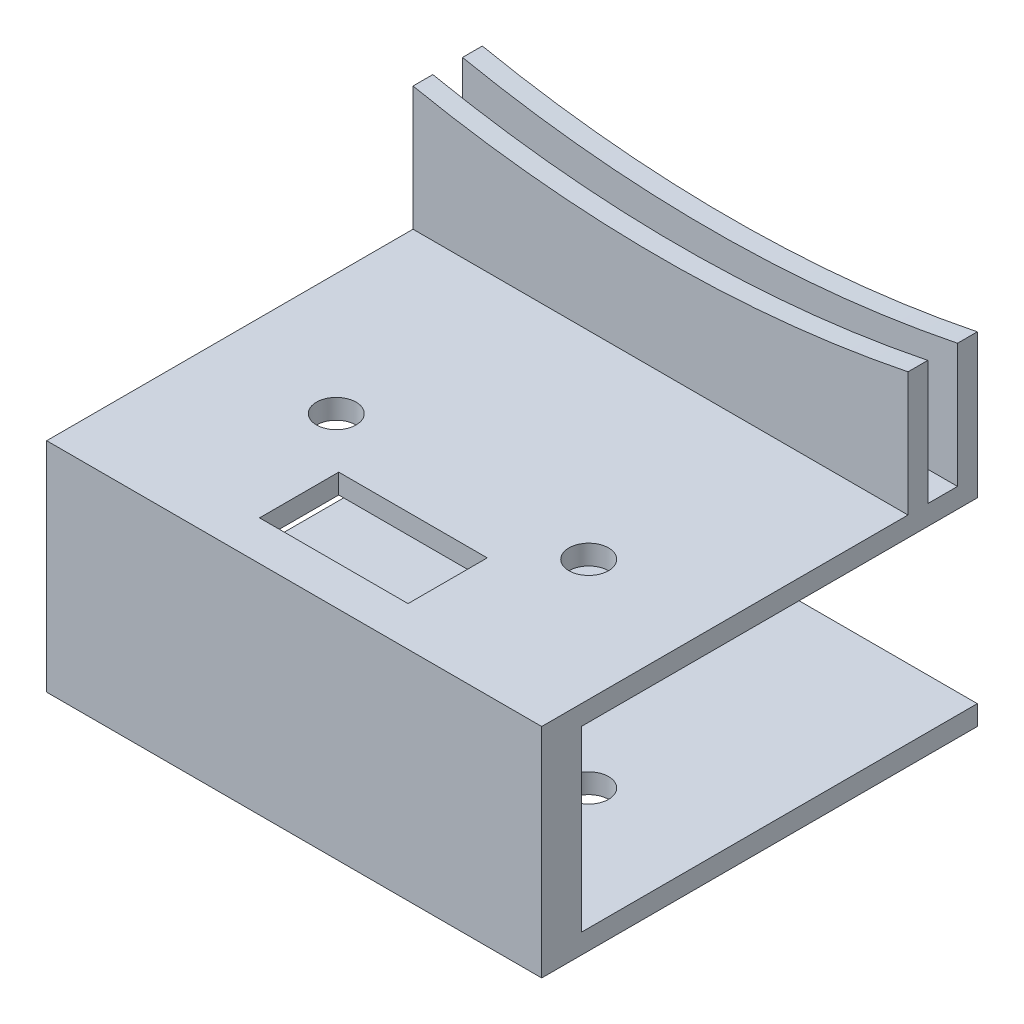
ISO-10303-21;
HEADER;
FILE_DESCRIPTION(('STEP AP214'),'2;1');
FILE_NAME('part.step','',(''),(''),'','','');
FILE_SCHEMA(('AUTOMOTIVE_DESIGN { 1 0 10303 214 1 1 1 1 }'));
ENDSEC;
DATA;
#1=APPLICATION_CONTEXT('core data for automotive mechanical design processes');
#2=APPLICATION_PROTOCOL_DEFINITION('international standard','automotive_design',2000,#1);
#3=PRODUCT_CONTEXT('',#1,'mechanical');
#4=PRODUCT('Part','Part','',(#3));
#5=PRODUCT_RELATED_PRODUCT_CATEGORY('part','',(#4));
#6=PRODUCT_DEFINITION_FORMATION('','',#4);
#7=PRODUCT_DEFINITION_CONTEXT('part definition',#1,'design');
#8=PRODUCT_DEFINITION('design','',#6,#7);
#9=PRODUCT_DEFINITION_SHAPE('','',#8);
#10=(LENGTH_UNIT() NAMED_UNIT(*) SI_UNIT(.MILLI.,.METRE.));
#11=(NAMED_UNIT(*) PLANE_ANGLE_UNIT() SI_UNIT($,.RADIAN.));
#12=(NAMED_UNIT(*) SI_UNIT($,.STERADIAN.) SOLID_ANGLE_UNIT());
#13=UNCERTAINTY_MEASURE_WITH_UNIT(LENGTH_MEASURE(1.E-05),#10,'distance_accuracy_value','');
#14=(GEOMETRIC_REPRESENTATION_CONTEXT(3) GLOBAL_UNCERTAINTY_ASSIGNED_CONTEXT((#13)) GLOBAL_UNIT_ASSIGNED_CONTEXT((#10,
#11,#12)) REPRESENTATION_CONTEXT('',''));
#15=CARTESIAN_POINT('',(0.,0.,0.));
#16=DIRECTION('',(0.,0.,1.));
#17=DIRECTION('',(1.,0.,0.));
#18=AXIS2_PLACEMENT_3D('',#15,#16,#17);
#19=CARTESIAN_POINT('',(-25.,22.,-22.));
#20=DIRECTION('',(0.,0.,1.));
#21=DIRECTION('',(1.,0.,0.));
#22=AXIS2_PLACEMENT_3D('',#19,#20,#21);
#23=PLANE('',#22);
#24=DIRECTION('',(0.,-1.,0.));
#25=VECTOR('',#24,1.);
#26=CARTESIAN_POINT('',(-25.,22.,-22.));
#27=LINE('',#26,#25);
#28=CARTESIAN_POINT('',(-25.,2.,-22.));
#29=VERTEX_POINT('',#28);
#30=CARTESIAN_POINT('',(-25.,0.,-22.));
#31=VERTEX_POINT('',#30);
#32=EDGE_CURVE('E214',#29,#31,#27,.T.);
#33=ORIENTED_EDGE('',*,*,#32,.F.);
#34=DIRECTION('',(1.,0.,0.));
#35=VECTOR('',#34,1.);
#36=CARTESIAN_POINT('',(-25.,2.,-22.));
#37=LINE('',#36,#35);
#38=CARTESIAN_POINT('',(25.,2.,-22.));
#39=VERTEX_POINT('',#38);
#40=EDGE_CURVE('E268',#29,#39,#37,.T.);
#41=ORIENTED_EDGE('',*,*,#40,.T.);
#42=DIRECTION('',(0.,-1.,0.));
#43=VECTOR('',#42,1.);
#44=CARTESIAN_POINT('',(25.,22.,-22.));
#45=LINE('',#44,#43);
#46=CARTESIAN_POINT('',(25.,0.,-22.));
#47=VERTEX_POINT('',#46);
#48=EDGE_CURVE('E217',#39,#47,#45,.T.);
#49=ORIENTED_EDGE('',*,*,#48,.T.);
#50=DIRECTION('',(-1.,0.,0.));
#51=VECTOR('',#50,1.);
#52=CARTESIAN_POINT('',(-25.,0.,-22.));
#53=LINE('',#52,#51);
#54=EDGE_CURVE('E202',#47,#31,#53,.T.);
#55=ORIENTED_EDGE('',*,*,#54,.T.);
#56=EDGE_LOOP('',(#33,#41,#49,#55));
#57=FACE_BOUND('',#56,.T.);
#58=ADVANCED_FACE('F33',(#57),#23,.F.);
#59=CARTESIAN_POINT('',(0.,22.,0.));
#60=DIRECTION('',(0.,1.,0.));
#61=DIRECTION('',(0.,0.,1.));
#62=AXIS2_PLACEMENT_3D('',#59,#60,#61);
#63=PLANE('',#62);
#64=DIRECTION('',(0.,0.,1.));
#65=VECTOR('',#64,1.);
#66=CARTESIAN_POINT('',(-7.5,22.,10.));
#67=LINE('',#66,#65);
#68=CARTESIAN_POINT('',(-7.5,22.,10.));
#69=VERTEX_POINT('',#68);
#70=CARTESIAN_POINT('',(-7.49999999999999,22.,18.));
#71=VERTEX_POINT('',#70);
#72=EDGE_CURVE('E337',#69,#71,#67,.T.);
#73=ORIENTED_EDGE('',*,*,#72,.F.);
#74=DIRECTION('',(-1.,0.,0.));
#75=VECTOR('',#74,1.);
#76=CARTESIAN_POINT('',(-7.5,22.,10.));
#77=LINE('',#76,#75);
#78=CARTESIAN_POINT('',(7.5,22.,10.));
#79=VERTEX_POINT('',#78);
#80=EDGE_CURVE('E333',#79,#69,#77,.T.);
#81=ORIENTED_EDGE('',*,*,#80,.F.);
#82=DIRECTION('',(0.,0.,-1.));
#83=VECTOR('',#82,1.);
#84=CARTESIAN_POINT('',(7.5,22.,10.));
#85=LINE('',#84,#83);
#86=CARTESIAN_POINT('',(7.5,22.,18.));
#87=VERTEX_POINT('',#86);
#88=EDGE_CURVE('E341',#87,#79,#85,.T.);
#89=ORIENTED_EDGE('',*,*,#88,.F.);
#90=DIRECTION('',(1.,0.,0.));
#91=VECTOR('',#90,1.);
#92=CARTESIAN_POINT('',(-7.49999999999999,22.,18.));
#93=LINE('',#92,#91);
#94=EDGE_CURVE('E339',#71,#87,#93,.T.);
#95=ORIENTED_EDGE('',*,*,#94,.F.);
#96=EDGE_LOOP('',(#73,#81,#89,#95));
#97=FACE_BOUND('',#96,.T.);
#98=CARTESIAN_POINT('',(-12.75,22.,5.));
#99=DIRECTION('',(0.,-1.,0.));
#100=DIRECTION('',(0.,0.,-1.));
#101=AXIS2_PLACEMENT_3D('',#98,#99,#100);
#102=CIRCLE('',#101,2.);
#103=CARTESIAN_POINT('',(-12.75,22.,3.));
#104=VERTEX_POINT('',#103);
#105=EDGE_CURVE('E226',#104,#104,#102,.T.);
#106=ORIENTED_EDGE('',*,*,#105,.T.);
#107=EDGE_LOOP('',(#106));
#108=FACE_BOUND('',#107,.T.);
#109=CARTESIAN_POINT('',(12.75,22.,5.));
#110=DIRECTION('',(0.,-1.,0.));
#111=DIRECTION('',(0.,0.,-1.));
#112=AXIS2_PLACEMENT_3D('',#109,#110,#111);
#113=CIRCLE('',#112,2.);
#114=CARTESIAN_POINT('',(12.75,22.,3.));
#115=VERTEX_POINT('',#114);
#116=EDGE_CURVE('E222',#115,#115,#113,.T.);
#117=ORIENTED_EDGE('',*,*,#116,.T.);
#118=EDGE_LOOP('',(#117));
#119=FACE_BOUND('',#118,.T.);
#120=DIRECTION('',(0.,0.,-1.));
#121=VECTOR('',#120,1.);
#122=CARTESIAN_POINT('',(25.,22.,-22.));
#123=LINE('',#122,#121);
#124=CARTESIAN_POINT('',(25.,22.,22.));
#125=VERTEX_POINT('',#124);
#126=CARTESIAN_POINT('',(25.,22.,-15.));
#127=VERTEX_POINT('',#126);
#128=EDGE_CURVE('E190',#125,#127,#123,.T.);
#129=ORIENTED_EDGE('',*,*,#128,.T.);
#130=DIRECTION('',(1.,0.,0.));
#131=VECTOR('',#130,1.);
#132=CARTESIAN_POINT('',(-25.,22.,-15.));
#133=LINE('',#132,#131);
#134=CARTESIAN_POINT('',(-25.,22.,-15.));
#135=VERTEX_POINT('',#134);
#136=EDGE_CURVE('E271',#135,#127,#133,.T.);
#137=ORIENTED_EDGE('',*,*,#136,.F.);
#138=DIRECTION('',(0.,0.,1.));
#139=VECTOR('',#138,1.);
#140=CARTESIAN_POINT('',(-25.,22.,-22.));
#141=LINE('',#140,#139);
#142=CARTESIAN_POINT('',(-25.,22.,22.));
#143=VERTEX_POINT('',#142);
#144=EDGE_CURVE('E176',#135,#143,#141,.T.);
#145=ORIENTED_EDGE('',*,*,#144,.T.);
#146=DIRECTION('',(1.,0.,0.));
#147=VECTOR('',#146,1.);
#148=CARTESIAN_POINT('',(-25.,22.,22.));
#149=LINE('',#148,#147);
#150=EDGE_CURVE('E197',#143,#125,#149,.T.);
#151=ORIENTED_EDGE('',*,*,#150,.T.);
#152=EDGE_LOOP('',(#129,#137,#145,#151));
#153=FACE_BOUND('',#152,.T.);
#154=ADVANCED_FACE('F355',(#97,#108,#119,#153),#63,.T.);
#155=CARTESIAN_POINT('',(-25.,22.,-20.));
#156=VERTEX_POINT('',#155);
#157=CARTESIAN_POINT('',(-25.,22.,-17.));
#158=VERTEX_POINT('',#157);
#159=EDGE_CURVE('E194',#156,#158,#141,.T.);
#160=ORIENTED_EDGE('',*,*,#159,.T.);
#161=DIRECTION('',(-1.,0.,0.));
#162=VECTOR('',#161,1.);
#163=CARTESIAN_POINT('',(-25.,22.,-17.));
#164=LINE('',#163,#162);
#165=CARTESIAN_POINT('',(25.,22.,-17.));
#166=VERTEX_POINT('',#165);
#167=EDGE_CURVE('E281',#166,#158,#164,.T.);
#168=ORIENTED_EDGE('',*,*,#167,.F.);
#169=CARTESIAN_POINT('',(25.,22.,-20.));
#170=VERTEX_POINT('',#169);
#171=EDGE_CURVE('E193',#166,#170,#123,.T.);
#172=ORIENTED_EDGE('',*,*,#171,.T.);
#173=DIRECTION('',(1.,0.,0.));
#174=VECTOR('',#173,1.);
#175=CARTESIAN_POINT('',(-25.,22.,-20.));
#176=LINE('',#175,#174);
#177=EDGE_CURVE('E177',#156,#170,#176,.T.);
#178=ORIENTED_EDGE('',*,*,#177,.F.);
#179=EDGE_LOOP('',(#160,#168,#172,#178));
#180=FACE_BOUND('',#179,.T.);
#181=ADVANCED_FACE('F293',(#180),#63,.T.);
#182=CARTESIAN_POINT('',(25.,22.,-22.));
#183=DIRECTION('',(-1.,0.,0.));
#184=DIRECTION('',(0.,0.,1.));
#185=AXIS2_PLACEMENT_3D('',#182,#183,#184);
#186=PLANE('',#185);
#187=CARTESIAN_POINT('',(25.,34.5255128608411,-22.));
#188=VERTEX_POINT('',#187);
#189=CARTESIAN_POINT('',(25.,20.,-22.));
#190=VERTEX_POINT('',#189);
#191=EDGE_CURVE('E41',#188,#190,#45,.T.);
#192=ORIENTED_EDGE('',*,*,#191,.F.);
#193=DIRECTION('',(0.,0.,-1.));
#194=VECTOR('',#193,1.);
#195=CARTESIAN_POINT('',(25.,34.5255128608411,-15.));
#196=LINE('',#195,#194);
#197=CARTESIAN_POINT('',(25.,34.5255128608411,-20.));
#198=VERTEX_POINT('',#197);
#199=EDGE_CURVE('E162',#198,#188,#196,.T.);
#200=ORIENTED_EDGE('',*,*,#199,.F.);
#201=DIRECTION('',(0.,-1.,0.));
#202=VECTOR('',#201,1.);
#203=CARTESIAN_POINT('',(25.,42.,-20.));
#204=LINE('',#203,#202);
#205=EDGE_CURVE('E180',#198,#170,#204,.T.);
#206=ORIENTED_EDGE('',*,*,#205,.T.);
#207=ORIENTED_EDGE('',*,*,#171,.F.);
#208=DIRECTION('',(0.,-1.,0.));
#209=VECTOR('',#208,1.);
#210=CARTESIAN_POINT('',(25.,42.,-17.));
#211=LINE('',#210,#209);
#212=CARTESIAN_POINT('',(25.,34.5255128608411,-17.));
#213=VERTEX_POINT('',#212);
#214=EDGE_CURVE('E182',#213,#166,#211,.T.);
#215=ORIENTED_EDGE('',*,*,#214,.F.);
#216=CARTESIAN_POINT('',(25.,34.5255128608411,-15.));
#217=VERTEX_POINT('',#216);
#218=EDGE_CURVE('E56',#217,#213,#196,.T.);
#219=ORIENTED_EDGE('',*,*,#218,.F.);
#220=DIRECTION('',(0.,-1.,0.));
#221=VECTOR('',#220,1.);
#222=CARTESIAN_POINT('',(25.,42.,-15.));
#223=LINE('',#222,#221);
#224=EDGE_CURVE('E170',#217,#127,#223,.T.);
#225=ORIENTED_EDGE('',*,*,#224,.T.);
#226=ORIENTED_EDGE('',*,*,#128,.F.);
#227=DIRECTION('',(0.,-1.,0.));
#228=VECTOR('',#227,1.);
#229=CARTESIAN_POINT('',(25.,22.,22.));
#230=LINE('',#229,#228);
#231=CARTESIAN_POINT('',(25.,0.,22.));
#232=VERTEX_POINT('',#231);
#233=EDGE_CURVE('E199',#125,#232,#230,.T.);
#234=ORIENTED_EDGE('',*,*,#233,.T.);
#235=DIRECTION('',(0.,0.,-1.));
#236=VECTOR('',#235,1.);
#237=CARTESIAN_POINT('',(25.,0.,-22.));
#238=LINE('',#237,#236);
#239=EDGE_CURVE('E189',#232,#47,#238,.T.);
#240=ORIENTED_EDGE('',*,*,#239,.T.);
#241=ORIENTED_EDGE('',*,*,#48,.F.);
#242=DIRECTION('',(0.,0.,-1.));
#243=VECTOR('',#242,1.);
#244=CARTESIAN_POINT('',(25.,2.,-22.));
#245=LINE('',#244,#243);
#246=CARTESIAN_POINT('',(25.,2.,18.));
#247=VERTEX_POINT('',#246);
#248=EDGE_CURVE('E255',#247,#39,#245,.T.);
#249=ORIENTED_EDGE('',*,*,#248,.F.);
#250=DIRECTION('',(0.,-1.,0.));
#251=VECTOR('',#250,1.);
#252=CARTESIAN_POINT('',(25.,20.,18.));
#253=LINE('',#252,#251);
#254=CARTESIAN_POINT('',(25.,20.,18.));
#255=VERTEX_POINT('',#254);
#256=EDGE_CURVE('E264',#255,#247,#253,.T.);
#257=ORIENTED_EDGE('',*,*,#256,.F.);
#258=DIRECTION('',(0.,0.,1.));
#259=VECTOR('',#258,1.);
#260=CARTESIAN_POINT('',(25.,20.,-22.));
#261=LINE('',#260,#259);
#262=EDGE_CURVE('E250',#190,#255,#261,.T.);
#263=ORIENTED_EDGE('',*,*,#262,.F.);
#264=EDGE_LOOP('',(#192,#200,#206,#207,#215,#219,#225,#226,#234,#240,#241,#249,#257,#263));
#265=FACE_BOUND('',#264,.T.);
#266=ADVANCED_FACE('F35',(#265),#186,.F.);
#267=CARTESIAN_POINT('',(-25.,34.5255128608411,-22.));
#268=VERTEX_POINT('',#267);
#269=CARTESIAN_POINT('',(-25.,20.,-22.));
#270=VERTEX_POINT('',#269);
#271=EDGE_CURVE('E215',#268,#270,#27,.T.);
#272=ORIENTED_EDGE('',*,*,#271,.F.);
#273=CARTESIAN_POINT('',(0.,157.,-22.));
#274=DIRECTION('',(0.,0.,-1.));
#275=DIRECTION('',(1.,0.,0.));
#276=AXIS2_PLACEMENT_3D('',#273,#274,#275);
#277=CIRCLE('',#276,125.);
#278=EDGE_CURVE('E171',#188,#268,#277,.T.);
#279=ORIENTED_EDGE('',*,*,#278,.F.);
#280=ORIENTED_EDGE('',*,*,#191,.T.);
#281=DIRECTION('',(1.,0.,0.));
#282=VECTOR('',#281,1.);
#283=CARTESIAN_POINT('',(-25.,20.,-22.));
#284=LINE('',#283,#282);
#285=EDGE_CURVE('E261',#270,#190,#284,.T.);
#286=ORIENTED_EDGE('',*,*,#285,.F.);
#287=EDGE_LOOP('',(#272,#279,#280,#286));
#288=FACE_BOUND('',#287,.T.);
#289=ADVANCED_FACE('F308',(#288),#23,.F.);
#290=CARTESIAN_POINT('',(-25.,22.,-22.));
#291=DIRECTION('',(1.,0.,0.));
#292=DIRECTION('',(0.,0.,-1.));
#293=AXIS2_PLACEMENT_3D('',#290,#291,#292);
#294=PLANE('',#293);
#295=DIRECTION('',(0.,-1.,0.));
#296=VECTOR('',#295,1.);
#297=CARTESIAN_POINT('',(-25.,42.,-15.));
#298=LINE('',#297,#296);
#299=CARTESIAN_POINT('',(-25.,34.5255128608411,-15.));
#300=VERTEX_POINT('',#299);
#301=EDGE_CURVE('E168',#300,#135,#298,.T.);
#302=ORIENTED_EDGE('',*,*,#301,.F.);
#303=DIRECTION('',(0.,0.,-1.));
#304=VECTOR('',#303,1.);
#305=CARTESIAN_POINT('',(-25.,34.5255128608411,-15.));
#306=LINE('',#305,#304);
#307=CARTESIAN_POINT('',(-25.,34.5255128608411,-17.));
#308=VERTEX_POINT('',#307);
#309=EDGE_CURVE('E155',#300,#308,#306,.T.);
#310=ORIENTED_EDGE('',*,*,#309,.T.);
#311=DIRECTION('',(0.,-1.,0.));
#312=VECTOR('',#311,1.);
#313=CARTESIAN_POINT('',(-25.,42.,-17.));
#314=LINE('',#313,#312);
#315=EDGE_CURVE('E284',#308,#158,#314,.T.);
#316=ORIENTED_EDGE('',*,*,#315,.T.);
#317=ORIENTED_EDGE('',*,*,#159,.F.);
#318=DIRECTION('',(0.,-1.,0.));
#319=VECTOR('',#318,1.);
#320=CARTESIAN_POINT('',(-25.,42.,-20.));
#321=LINE('',#320,#319);
#322=CARTESIAN_POINT('',(-25.,34.5255128608411,-20.));
#323=VERTEX_POINT('',#322);
#324=EDGE_CURVE('E187',#323,#156,#321,.T.);
#325=ORIENTED_EDGE('',*,*,#324,.F.);
#326=EDGE_CURVE('E48',#323,#268,#306,.T.);
#327=ORIENTED_EDGE('',*,*,#326,.T.);
#328=ORIENTED_EDGE('',*,*,#271,.T.);
#329=DIRECTION('',(0.,0.,1.));
#330=VECTOR('',#329,1.);
#331=CARTESIAN_POINT('',(-25.,20.,-22.));
#332=LINE('',#331,#330);
#333=CARTESIAN_POINT('',(-25.,20.,18.));
#334=VERTEX_POINT('',#333);
#335=EDGE_CURVE('E251',#270,#334,#332,.T.);
#336=ORIENTED_EDGE('',*,*,#335,.T.);
#337=DIRECTION('',(0.,-1.,0.));
#338=VECTOR('',#337,1.);
#339=CARTESIAN_POINT('',(-25.,20.,18.));
#340=LINE('',#339,#338);
#341=CARTESIAN_POINT('',(-25.,2.,18.));
#342=VERTEX_POINT('',#341);
#343=EDGE_CURVE('E254',#334,#342,#340,.T.);
#344=ORIENTED_EDGE('',*,*,#343,.T.);
#345=DIRECTION('',(0.,0.,-1.));
#346=VECTOR('',#345,1.);
#347=CARTESIAN_POINT('',(-25.,2.,-22.));
#348=LINE('',#347,#346);
#349=EDGE_CURVE('E258',#342,#29,#348,.T.);
#350=ORIENTED_EDGE('',*,*,#349,.T.);
#351=ORIENTED_EDGE('',*,*,#32,.T.);
#352=DIRECTION('',(0.,0.,1.));
#353=VECTOR('',#352,1.);
#354=CARTESIAN_POINT('',(-25.,0.,-22.));
#355=LINE('',#354,#353);
#356=CARTESIAN_POINT('',(-25.,0.,22.));
#357=VERTEX_POINT('',#356);
#358=EDGE_CURVE('E205',#31,#357,#355,.T.);
#359=ORIENTED_EDGE('',*,*,#358,.T.);
#360=DIRECTION('',(0.,-1.,0.));
#361=VECTOR('',#360,1.);
#362=CARTESIAN_POINT('',(-25.,22.,22.));
#363=LINE('',#362,#361);
#364=EDGE_CURVE('E211',#143,#357,#363,.T.);
#365=ORIENTED_EDGE('',*,*,#364,.F.);
#366=ORIENTED_EDGE('',*,*,#144,.F.);
#367=EDGE_LOOP('',(#302,#310,#316,#317,#325,#327,#328,#336,#344,#350,#351,#359,#365,#366));
#368=FACE_BOUND('',#367,.T.);
#369=ADVANCED_FACE('F174',(#368),#294,.F.);
#370=CARTESIAN_POINT('',(-25.,22.,22.));
#371=DIRECTION('',(0.,0.,-1.));
#372=DIRECTION('',(-1.,0.,0.));
#373=AXIS2_PLACEMENT_3D('',#370,#371,#372);
#374=PLANE('',#373);
#375=DIRECTION('',(1.,0.,0.));
#376=VECTOR('',#375,1.);
#377=CARTESIAN_POINT('',(-25.,0.,22.));
#378=LINE('',#377,#376);
#379=EDGE_CURVE('E207',#357,#232,#378,.T.);
#380=ORIENTED_EDGE('',*,*,#379,.T.);
#381=ORIENTED_EDGE('',*,*,#233,.F.);
#382=ORIENTED_EDGE('',*,*,#150,.F.);
#383=ORIENTED_EDGE('',*,*,#364,.T.);
#384=EDGE_LOOP('',(#380,#381,#382,#383));
#385=FACE_BOUND('',#384,.T.);
#386=ADVANCED_FACE('F372',(#385),#374,.F.);
#387=CARTESIAN_POINT('',(0.,0.,0.));
#388=DIRECTION('',(0.,1.,0.));
#389=DIRECTION('',(0.,0.,1.));
#390=AXIS2_PLACEMENT_3D('',#387,#388,#389);
#391=PLANE('',#390);
#392=CARTESIAN_POINT('',(-12.75,0.,5.));
#393=DIRECTION('',(0.,-1.,0.));
#394=DIRECTION('',(0.,0.,-1.));
#395=AXIS2_PLACEMENT_3D('',#392,#393,#394);
#396=CIRCLE('',#395,2.);
#397=CARTESIAN_POINT('',(-12.75,0.,3.));
#398=VERTEX_POINT('',#397);
#399=EDGE_CURVE('E233',#398,#398,#396,.T.);
#400=ORIENTED_EDGE('',*,*,#399,.F.);
#401=EDGE_LOOP('',(#400));
#402=FACE_BOUND('',#401,.T.);
#403=CARTESIAN_POINT('',(12.75,0.,5.));
#404=DIRECTION('',(0.,-1.,0.));
#405=DIRECTION('',(0.,0.,-1.));
#406=AXIS2_PLACEMENT_3D('',#403,#404,#405);
#407=CIRCLE('',#406,2.);
#408=CARTESIAN_POINT('',(12.75,0.,3.));
#409=VERTEX_POINT('',#408);
#410=EDGE_CURVE('E230',#409,#409,#407,.T.);
#411=ORIENTED_EDGE('',*,*,#410,.F.);
#412=EDGE_LOOP('',(#411));
#413=FACE_BOUND('',#412,.T.);
#414=ORIENTED_EDGE('',*,*,#239,.F.);
#415=ORIENTED_EDGE('',*,*,#379,.F.);
#416=ORIENTED_EDGE('',*,*,#358,.F.);
#417=ORIENTED_EDGE('',*,*,#54,.F.);
#418=EDGE_LOOP('',(#414,#415,#416,#417));
#419=FACE_BOUND('',#418,.T.);
#420=ADVANCED_FACE('F369',(#402,#413,#419),#391,.F.);
#421=CARTESIAN_POINT('',(-25.,42.,-20.));
#422=DIRECTION('',(0.,0.,-1.));
#423=DIRECTION('',(-1.,0.,0.));
#424=AXIS2_PLACEMENT_3D('',#421,#422,#423);
#425=PLANE('',#424);
#426=ORIENTED_EDGE('',*,*,#205,.F.);
#427=CARTESIAN_POINT('',(0.,157.,-20.));
#428=DIRECTION('',(0.,0.,-1.));
#429=DIRECTION('',(-1.,0.,0.));
#430=AXIS2_PLACEMENT_3D('',#427,#428,#429);
#431=CIRCLE('',#430,125.);
#432=EDGE_CURVE('E301',#198,#323,#431,.T.);
#433=ORIENTED_EDGE('',*,*,#432,.T.);
#434=ORIENTED_EDGE('',*,*,#324,.T.);
#435=ORIENTED_EDGE('',*,*,#177,.T.);
#436=EDGE_LOOP('',(#426,#433,#434,#435));
#437=FACE_BOUND('',#436,.T.);
#438=ADVANCED_FACE('F300',(#437),#425,.F.);
#439=CARTESIAN_POINT('',(-25.,42.,-15.));
#440=DIRECTION('',(0.,0.,-1.));
#441=DIRECTION('',(-1.,0.,0.));
#442=AXIS2_PLACEMENT_3D('',#439,#440,#441);
#443=PLANE('',#442);
#444=ORIENTED_EDGE('',*,*,#224,.F.);
#445=CARTESIAN_POINT('',(0.,157.,-15.));
#446=DIRECTION('',(0.,0.,-1.));
#447=DIRECTION('',(1.,0.,0.));
#448=AXIS2_PLACEMENT_3D('',#445,#446,#447);
#449=CIRCLE('',#448,125.);
#450=EDGE_CURVE('E158',#217,#300,#449,.T.);
#451=ORIENTED_EDGE('',*,*,#450,.T.);
#452=ORIENTED_EDGE('',*,*,#301,.T.);
#453=ORIENTED_EDGE('',*,*,#136,.T.);
#454=EDGE_LOOP('',(#444,#451,#452,#453));
#455=FACE_BOUND('',#454,.T.);
#456=ADVANCED_FACE('F166',(#455),#443,.F.);
#457=CARTESIAN_POINT('',(-25.,42.,-17.));
#458=DIRECTION('',(0.,0.,1.));
#459=DIRECTION('',(1.,0.,0.));
#460=AXIS2_PLACEMENT_3D('',#457,#458,#459);
#461=PLANE('',#460);
#462=ORIENTED_EDGE('',*,*,#315,.F.);
#463=CARTESIAN_POINT('',(0.,157.,-17.));
#464=DIRECTION('',(0.,0.,1.));
#465=DIRECTION('',(1.,0.,0.));
#466=AXIS2_PLACEMENT_3D('',#463,#464,#465);
#467=CIRCLE('',#466,125.);
#468=EDGE_CURVE('E11',#308,#213,#467,.T.);
#469=ORIENTED_EDGE('',*,*,#468,.T.);
#470=ORIENTED_EDGE('',*,*,#214,.T.);
#471=ORIENTED_EDGE('',*,*,#167,.T.);
#472=EDGE_LOOP('',(#462,#469,#470,#471));
#473=FACE_BOUND('',#472,.T.);
#474=ADVANCED_FACE('F288',(#473),#461,.F.);
#475=CARTESIAN_POINT('',(-25.,2.,-22.));
#476=DIRECTION('',(0.,-1.,0.));
#477=DIRECTION('',(0.,0.,-1.));
#478=AXIS2_PLACEMENT_3D('',#475,#476,#477);
#479=PLANE('',#478);
#480=CARTESIAN_POINT('',(-12.75,2.,5.));
#481=DIRECTION('',(0.,-1.,0.));
#482=DIRECTION('',(0.,0.,-1.));
#483=AXIS2_PLACEMENT_3D('',#480,#481,#482);
#484=CIRCLE('',#483,2.);
#485=CARTESIAN_POINT('',(-12.75,2.,3.));
#486=VERTEX_POINT('',#485);
#487=EDGE_CURVE('E225',#486,#486,#484,.T.);
#488=ORIENTED_EDGE('',*,*,#487,.T.);
#489=EDGE_LOOP('',(#488));
#490=FACE_BOUND('',#489,.T.);
#491=CARTESIAN_POINT('',(12.75,2.,5.));
#492=DIRECTION('',(0.,-1.,0.));
#493=DIRECTION('',(0.,0.,-1.));
#494=AXIS2_PLACEMENT_3D('',#491,#492,#493);
#495=CIRCLE('',#494,2.);
#496=CARTESIAN_POINT('',(12.75,2.,3.));
#497=VERTEX_POINT('',#496);
#498=EDGE_CURVE('E221',#497,#497,#495,.T.);
#499=ORIENTED_EDGE('',*,*,#498,.T.);
#500=EDGE_LOOP('',(#499));
#501=FACE_BOUND('',#500,.T.);
#502=ORIENTED_EDGE('',*,*,#248,.T.);
#503=ORIENTED_EDGE('',*,*,#40,.F.);
#504=ORIENTED_EDGE('',*,*,#349,.F.);
#505=DIRECTION('',(1.,0.,0.));
#506=VECTOR('',#505,1.);
#507=CARTESIAN_POINT('',(-25.,2.,18.));
#508=LINE('',#507,#506);
#509=EDGE_CURVE('E272',#342,#247,#508,.T.);
#510=ORIENTED_EDGE('',*,*,#509,.T.);
#511=EDGE_LOOP('',(#502,#503,#504,#510));
#512=FACE_BOUND('',#511,.T.);
#513=ADVANCED_FACE('F433',(#490,#501,#512),#479,.F.);
#514=CARTESIAN_POINT('',(-25.,20.,18.));
#515=DIRECTION('',(0.,0.,1.));
#516=DIRECTION('',(1.,0.,0.));
#517=AXIS2_PLACEMENT_3D('',#514,#515,#516);
#518=PLANE('',#517);
#519=ORIENTED_EDGE('',*,*,#256,.T.);
#520=ORIENTED_EDGE('',*,*,#509,.F.);
#521=ORIENTED_EDGE('',*,*,#343,.F.);
#522=DIRECTION('',(1.,0.,0.));
#523=VECTOR('',#522,1.);
#524=CARTESIAN_POINT('',(-25.,20.,18.));
#525=LINE('',#524,#523);
#526=CARTESIAN_POINT('',(-7.49999999999999,20.,18.));
#527=VERTEX_POINT('',#526);
#528=EDGE_CURVE('E274',#334,#527,#525,.T.);
#529=ORIENTED_EDGE('',*,*,#528,.T.);
#530=DIRECTION('',(0.,1.,0.));
#531=VECTOR('',#530,1.);
#532=CARTESIAN_POINT('',(-7.49999999999999,20.,18.));
#533=LINE('',#532,#531);
#534=EDGE_CURVE('E241',#527,#71,#533,.T.);
#535=ORIENTED_EDGE('',*,*,#534,.T.);
#536=ORIENTED_EDGE('',*,*,#94,.T.);
#537=DIRECTION('',(0.,1.,0.));
#538=VECTOR('',#537,1.);
#539=CARTESIAN_POINT('',(7.5,20.,18.));
#540=LINE('',#539,#538);
#541=CARTESIAN_POINT('',(7.5,20.,18.));
#542=VERTEX_POINT('',#541);
#543=EDGE_CURVE('E323',#542,#87,#540,.T.);
#544=ORIENTED_EDGE('',*,*,#543,.F.);
#545=EDGE_CURVE('E277',#542,#255,#525,.T.);
#546=ORIENTED_EDGE('',*,*,#545,.T.);
#547=EDGE_LOOP('',(#519,#520,#521,#529,#535,#536,#544,#546));
#548=FACE_BOUND('',#547,.T.);
#549=ADVANCED_FACE('F319',(#548),#518,.F.);
#550=CARTESIAN_POINT('',(-25.,20.,-22.));
#551=DIRECTION('',(0.,1.,0.));
#552=DIRECTION('',(0.,0.,1.));
#553=AXIS2_PLACEMENT_3D('',#550,#551,#552);
#554=PLANE('',#553);
#555=CARTESIAN_POINT('',(-12.75,20.,5.));
#556=DIRECTION('',(0.,1.,0.));
#557=DIRECTION('',(0.,0.,1.));
#558=AXIS2_PLACEMENT_3D('',#555,#556,#557);
#559=CIRCLE('',#558,2.);
#560=CARTESIAN_POINT('',(-12.75,20.,7.));
#561=VERTEX_POINT('',#560);
#562=EDGE_CURVE('E223',#561,#561,#559,.T.);
#563=ORIENTED_EDGE('',*,*,#562,.T.);
#564=EDGE_LOOP('',(#563));
#565=FACE_BOUND('',#564,.T.);
#566=CARTESIAN_POINT('',(12.75,20.,5.));
#567=DIRECTION('',(0.,1.,0.));
#568=DIRECTION('',(0.,0.,1.));
#569=AXIS2_PLACEMENT_3D('',#566,#567,#568);
#570=CIRCLE('',#569,2.);
#571=CARTESIAN_POINT('',(12.75,20.,7.00000000000001));
#572=VERTEX_POINT('',#571);
#573=EDGE_CURVE('E219',#572,#572,#570,.T.);
#574=ORIENTED_EDGE('',*,*,#573,.T.);
#575=EDGE_LOOP('',(#574));
#576=FACE_BOUND('',#575,.T.);
#577=DIRECTION('',(-1.,0.,0.));
#578=VECTOR('',#577,1.);
#579=CARTESIAN_POINT('',(-7.5,20.,10.));
#580=LINE('',#579,#578);
#581=CARTESIAN_POINT('',(7.5,20.,10.));
#582=VERTEX_POINT('',#581);
#583=CARTESIAN_POINT('',(-7.5,20.,10.));
#584=VERTEX_POINT('',#583);
#585=EDGE_CURVE('E328',#582,#584,#580,.T.);
#586=ORIENTED_EDGE('',*,*,#585,.T.);
#587=DIRECTION('',(0.,0.,1.));
#588=VECTOR('',#587,1.);
#589=CARTESIAN_POINT('',(-7.5,20.,10.));
#590=LINE('',#589,#588);
#591=EDGE_CURVE('E330',#584,#527,#590,.T.);
#592=ORIENTED_EDGE('',*,*,#591,.T.);
#593=ORIENTED_EDGE('',*,*,#528,.F.);
#594=ORIENTED_EDGE('',*,*,#335,.F.);
#595=ORIENTED_EDGE('',*,*,#285,.T.);
#596=ORIENTED_EDGE('',*,*,#262,.T.);
#597=ORIENTED_EDGE('',*,*,#545,.F.);
#598=DIRECTION('',(0.,0.,-1.));
#599=VECTOR('',#598,1.);
#600=CARTESIAN_POINT('',(7.5,20.,10.));
#601=LINE('',#600,#599);
#602=EDGE_CURVE('E325',#542,#582,#601,.T.);
#603=ORIENTED_EDGE('',*,*,#602,.T.);
#604=EDGE_LOOP('',(#586,#592,#593,#594,#595,#596,#597,#603));
#605=FACE_BOUND('',#604,.T.);
#606=ADVANCED_FACE('F312',(#565,#576,#605),#554,.F.);
#607=CARTESIAN_POINT('',(12.75,22.,5.));
#608=DIRECTION('',(0.,-1.,0.));
#609=DIRECTION('',(0.,0.,-1.));
#610=AXIS2_PLACEMENT_3D('',#607,#608,#609);
#611=CYLINDRICAL_SURFACE('',#610,2.);
#612=ORIENTED_EDGE('',*,*,#116,.F.);
#613=EDGE_LOOP('',(#612));
#614=FACE_BOUND('',#613,.T.);
#615=ORIENTED_EDGE('',*,*,#573,.F.);
#616=EDGE_LOOP('',(#615));
#617=FACE_BOUND('',#616,.T.);
#618=ADVANCED_FACE('F455',(#614,#617),#611,.F.);
#619=ORIENTED_EDGE('',*,*,#410,.T.);
#620=EDGE_LOOP('',(#619));
#621=FACE_BOUND('',#620,.T.);
#622=ORIENTED_EDGE('',*,*,#498,.F.);
#623=EDGE_LOOP('',(#622));
#624=FACE_BOUND('',#623,.T.);
#625=ADVANCED_FACE('F462',(#621,#624),#611,.F.);
#626=CARTESIAN_POINT('',(-12.75,22.,5.));
#627=DIRECTION('',(0.,-1.,0.));
#628=DIRECTION('',(0.,0.,-1.));
#629=AXIS2_PLACEMENT_3D('',#626,#627,#628);
#630=CYLINDRICAL_SURFACE('',#629,2.);
#631=ORIENTED_EDGE('',*,*,#105,.F.);
#632=EDGE_LOOP('',(#631));
#633=FACE_BOUND('',#632,.T.);
#634=ORIENTED_EDGE('',*,*,#562,.F.);
#635=EDGE_LOOP('',(#634));
#636=FACE_BOUND('',#635,.T.);
#637=ADVANCED_FACE('F470',(#633,#636),#630,.F.);
#638=ORIENTED_EDGE('',*,*,#399,.T.);
#639=EDGE_LOOP('',(#638));
#640=FACE_BOUND('',#639,.T.);
#641=ORIENTED_EDGE('',*,*,#487,.F.);
#642=EDGE_LOOP('',(#641));
#643=FACE_BOUND('',#642,.T.);
#644=ADVANCED_FACE('F477',(#640,#643),#630,.F.);
#645=CARTESIAN_POINT('',(-7.5,20.,10.));
#646=DIRECTION('',(-1.,0.,0.));
#647=DIRECTION('',(0.,0.,1.));
#648=AXIS2_PLACEMENT_3D('',#645,#646,#647);
#649=PLANE('',#648);
#650=ORIENTED_EDGE('',*,*,#72,.T.);
#651=ORIENTED_EDGE('',*,*,#534,.F.);
#652=ORIENTED_EDGE('',*,*,#591,.F.);
#653=DIRECTION('',(0.,1.,0.));
#654=VECTOR('',#653,1.);
#655=CARTESIAN_POINT('',(-7.5,20.,10.));
#656=LINE('',#655,#654);
#657=EDGE_CURVE('E238',#584,#69,#656,.T.);
#658=ORIENTED_EDGE('',*,*,#657,.T.);
#659=EDGE_LOOP('',(#650,#651,#652,#658));
#660=FACE_BOUND('',#659,.T.);
#661=ADVANCED_FACE('F360',(#660),#649,.F.);
#662=CARTESIAN_POINT('',(-7.5,20.,10.));
#663=DIRECTION('',(0.,0.,-1.));
#664=DIRECTION('',(-1.,0.,0.));
#665=AXIS2_PLACEMENT_3D('',#662,#663,#664);
#666=PLANE('',#665);
#667=ORIENTED_EDGE('',*,*,#80,.T.);
#668=ORIENTED_EDGE('',*,*,#657,.F.);
#669=ORIENTED_EDGE('',*,*,#585,.F.);
#670=DIRECTION('',(0.,1.,0.));
#671=VECTOR('',#670,1.);
#672=CARTESIAN_POINT('',(7.5,20.,10.));
#673=LINE('',#672,#671);
#674=EDGE_CURVE('E347',#582,#79,#673,.T.);
#675=ORIENTED_EDGE('',*,*,#674,.T.);
#676=EDGE_LOOP('',(#667,#668,#669,#675));
#677=FACE_BOUND('',#676,.T.);
#678=ADVANCED_FACE('F359',(#677),#666,.F.);
#679=CARTESIAN_POINT('',(7.5,20.,10.));
#680=DIRECTION('',(1.,0.,0.));
#681=DIRECTION('',(0.,0.,-1.));
#682=AXIS2_PLACEMENT_3D('',#679,#680,#681);
#683=PLANE('',#682);
#684=ORIENTED_EDGE('',*,*,#88,.T.);
#685=ORIENTED_EDGE('',*,*,#674,.F.);
#686=ORIENTED_EDGE('',*,*,#602,.F.);
#687=ORIENTED_EDGE('',*,*,#543,.T.);
#688=EDGE_LOOP('',(#684,#685,#686,#687));
#689=FACE_BOUND('',#688,.T.);
#690=ADVANCED_FACE('F357',(#689),#683,.F.);
#691=CARTESIAN_POINT('',(0.,157.,-15.));
#692=DIRECTION('',(0.,0.,-1.));
#693=DIRECTION('',(-1.,0.,0.));
#694=AXIS2_PLACEMENT_3D('',#691,#692,#693);
#695=CYLINDRICAL_SURFACE('',#694,125.);
#696=ORIENTED_EDGE('',*,*,#309,.F.);
#697=ORIENTED_EDGE('',*,*,#450,.F.);
#698=ORIENTED_EDGE('',*,*,#218,.T.);
#699=ORIENTED_EDGE('',*,*,#468,.F.);
#700=EDGE_LOOP('',(#696,#697,#698,#699));
#701=FACE_BOUND('',#700,.T.);
#702=ADVANCED_FACE('F157',(#701),#695,.F.);
#703=ORIENTED_EDGE('',*,*,#199,.T.);
#704=ORIENTED_EDGE('',*,*,#278,.T.);
#705=ORIENTED_EDGE('',*,*,#326,.F.);
#706=ORIENTED_EDGE('',*,*,#432,.F.);
#707=EDGE_LOOP('',(#703,#704,#705,#706));
#708=FACE_BOUND('',#707,.T.);
#709=ADVANCED_FACE('F378',(#708),#695,.F.);
#710=CLOSED_SHELL('',(#58,#154,#181,#266,#289,#369,#386,#420,#438,#456,#474,#513,#549,#606,#618,
#625,#637,#644,#661,#678,#690,#702,#709));
#711=MANIFOLD_SOLID_BREP('B2',#710);
#712=ADVANCED_BREP_SHAPE_REPRESENTATION('',(#18,#711),#14);
#713=SHAPE_DEFINITION_REPRESENTATION(#9,#712);
ENDSEC;
END-ISO-10303-21;
